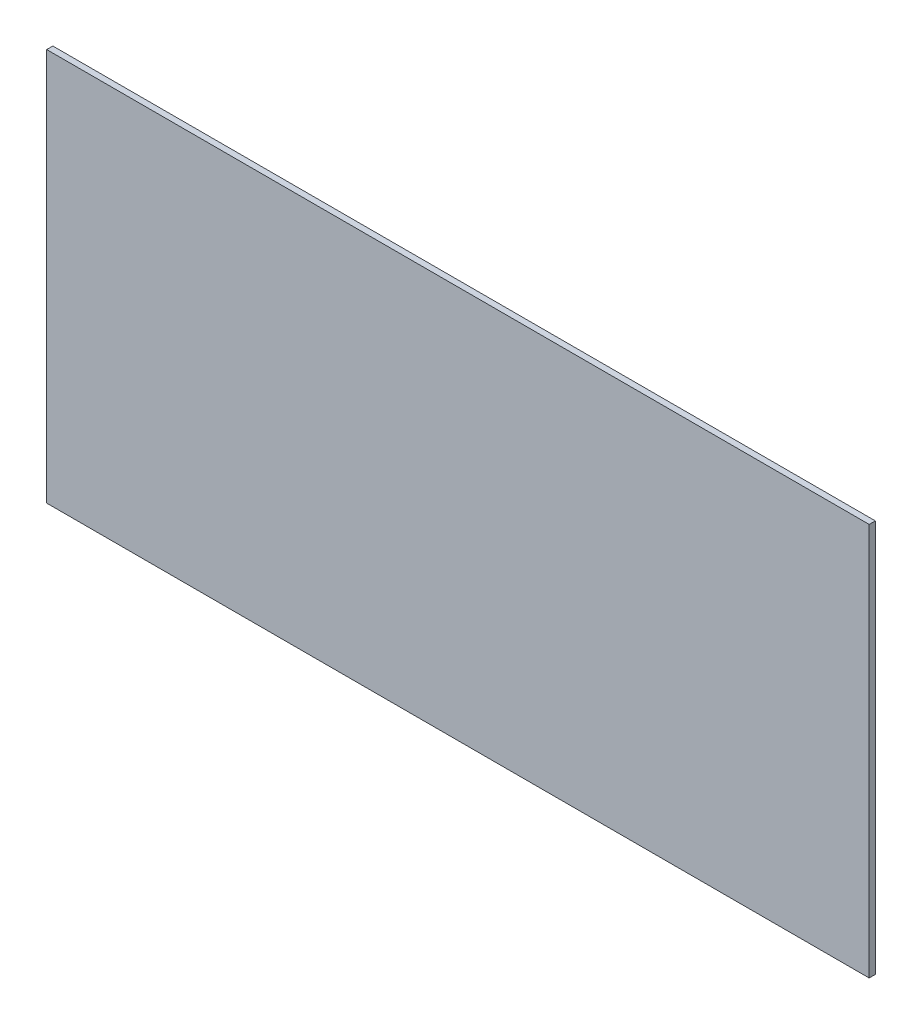
ISO-10303-21;
HEADER;
FILE_DESCRIPTION(('STEP AP214'),'2;1');
FILE_NAME('part.step','',(''),(''),'','','');
FILE_SCHEMA(('AUTOMOTIVE_DESIGN { 1 0 10303 214 1 1 1 1 }'));
ENDSEC;
DATA;
#1=APPLICATION_CONTEXT('core data for automotive mechanical design processes');
#2=APPLICATION_PROTOCOL_DEFINITION('international standard','automotive_design',2000,#1);
#3=PRODUCT_CONTEXT('',#1,'mechanical');
#4=PRODUCT('Part','Part','',(#3));
#5=PRODUCT_RELATED_PRODUCT_CATEGORY('part','',(#4));
#6=PRODUCT_DEFINITION_FORMATION('','',#4);
#7=PRODUCT_DEFINITION_CONTEXT('part definition',#1,'design');
#8=PRODUCT_DEFINITION('design','',#6,#7);
#9=PRODUCT_DEFINITION_SHAPE('','',#8);
#10=(LENGTH_UNIT() NAMED_UNIT(*) SI_UNIT(.MILLI.,.METRE.));
#11=(NAMED_UNIT(*) PLANE_ANGLE_UNIT() SI_UNIT($,.RADIAN.));
#12=(NAMED_UNIT(*) SI_UNIT($,.STERADIAN.) SOLID_ANGLE_UNIT());
#13=UNCERTAINTY_MEASURE_WITH_UNIT(LENGTH_MEASURE(1.E-05),#10,'distance_accuracy_value','');
#14=(GEOMETRIC_REPRESENTATION_CONTEXT(3) GLOBAL_UNCERTAINTY_ASSIGNED_CONTEXT((#13)) GLOBAL_UNIT_ASSIGNED_CONTEXT((#10,
#11,#12)) REPRESENTATION_CONTEXT('',''));
#15=CARTESIAN_POINT('',(0.,0.,0.));
#16=DIRECTION('',(0.,0.,1.));
#17=DIRECTION('',(1.,0.,0.));
#18=AXIS2_PLACEMENT_3D('',#15,#16,#17);
#19=CARTESIAN_POINT('',(-604.30004543329,321.842900302115,10.));
#20=DIRECTION('',(1.,0.,0.));
#21=DIRECTION('',(0.,1.,0.));
#22=AXIS2_PLACEMENT_3D('',#19,#20,#21);
#23=PLANE('',#22);
#24=DIRECTION('',(0.,-1.,0.));
#25=VECTOR('',#24,1.);
#26=CARTESIAN_POINT('',(-604.30004543329,321.842900302115,0.));
#27=LINE('',#26,#25);
#28=CARTESIAN_POINT('',(-604.30004543329,321.842900302115,0.));
#29=VERTEX_POINT('',#28);
#30=CARTESIAN_POINT('',(-604.30004543329,-318.157099697885,0.));
#31=VERTEX_POINT('',#30);
#32=EDGE_CURVE('E97',#29,#31,#27,.T.);
#33=ORIENTED_EDGE('',*,*,#32,.T.);
#34=DIRECTION('',(0.,0.,-1.));
#35=VECTOR('',#34,1.);
#36=CARTESIAN_POINT('',(-604.30004543329,-318.157099697885,10.));
#37=LINE('',#36,#35);
#38=CARTESIAN_POINT('',(-604.30004543329,-318.157099697885,10.));
#39=VERTEX_POINT('',#38);
#40=EDGE_CURVE('E11',#39,#31,#37,.T.);
#41=ORIENTED_EDGE('',*,*,#40,.F.);
#42=DIRECTION('',(0.,-1.,0.));
#43=VECTOR('',#42,1.);
#44=CARTESIAN_POINT('',(-604.30004543329,321.842900302115,10.));
#45=LINE('',#44,#43);
#46=CARTESIAN_POINT('',(-604.30004543329,321.842900302115,10.));
#47=VERTEX_POINT('',#46);
#48=EDGE_CURVE('E85',#47,#39,#45,.T.);
#49=ORIENTED_EDGE('',*,*,#48,.F.);
#50=DIRECTION('',(0.,0.,-1.));
#51=VECTOR('',#50,1.);
#52=CARTESIAN_POINT('',(-604.30004543329,321.842900302115,10.));
#53=LINE('',#52,#51);
#54=EDGE_CURVE('E93',#47,#29,#53,.T.);
#55=ORIENTED_EDGE('',*,*,#54,.T.);
#56=EDGE_LOOP('',(#33,#41,#49,#55));
#57=FACE_BOUND('',#56,.T.);
#58=ADVANCED_FACE('F34',(#57),#23,.F.);
#59=CARTESIAN_POINT('',(-604.30004543329,-318.157099697885,10.));
#60=DIRECTION('',(0.,1.,0.));
#61=DIRECTION('',(0.,0.,1.));
#62=AXIS2_PLACEMENT_3D('',#59,#60,#61);
#63=PLANE('',#62);
#64=DIRECTION('',(1.,0.,0.));
#65=VECTOR('',#64,1.);
#66=CARTESIAN_POINT('',(-604.30004543329,-318.157099697885,0.));
#67=LINE('',#66,#65);
#68=CARTESIAN_POINT('',(735.69995456671,-318.157099697885,0.));
#69=VERTEX_POINT('',#68);
#70=EDGE_CURVE('E89',#31,#69,#67,.T.);
#71=ORIENTED_EDGE('',*,*,#70,.T.);
#72=DIRECTION('',(0.,0.,-1.));
#73=VECTOR('',#72,1.);
#74=CARTESIAN_POINT('',(735.69995456671,-318.157099697885,10.));
#75=LINE('',#74,#73);
#76=CARTESIAN_POINT('',(735.69995456671,-318.157099697885,10.));
#77=VERTEX_POINT('',#76);
#78=EDGE_CURVE('E42',#77,#69,#75,.T.);
#79=ORIENTED_EDGE('',*,*,#78,.F.);
#80=DIRECTION('',(1.,0.,0.));
#81=VECTOR('',#80,1.);
#82=CARTESIAN_POINT('',(-604.30004543329,-318.157099697885,10.));
#83=LINE('',#82,#81);
#84=EDGE_CURVE('E80',#39,#77,#83,.T.);
#85=ORIENTED_EDGE('',*,*,#84,.F.);
#86=ORIENTED_EDGE('',*,*,#40,.T.);
#87=EDGE_LOOP('',(#71,#79,#85,#86));
#88=FACE_BOUND('',#87,.T.);
#89=ADVANCED_FACE('F88',(#88),#63,.F.);
#90=CARTESIAN_POINT('',(735.69995456671,321.842900302115,10.));
#91=DIRECTION('',(-1.,0.,0.));
#92=DIRECTION('',(0.,-1.,0.));
#93=AXIS2_PLACEMENT_3D('',#90,#91,#92);
#94=PLANE('',#93);
#95=DIRECTION('',(0.,1.,0.));
#96=VECTOR('',#95,1.);
#97=CARTESIAN_POINT('',(735.69995456671,321.842900302115,0.));
#98=LINE('',#97,#96);
#99=CARTESIAN_POINT('',(735.69995456671,321.842900302115,0.));
#100=VERTEX_POINT('',#99);
#101=EDGE_CURVE('E67',#69,#100,#98,.T.);
#102=ORIENTED_EDGE('',*,*,#101,.T.);
#103=DIRECTION('',(0.,0.,-1.));
#104=VECTOR('',#103,1.);
#105=CARTESIAN_POINT('',(735.69995456671,321.842900302115,10.));
#106=LINE('',#105,#104);
#107=CARTESIAN_POINT('',(735.69995456671,321.842900302115,10.));
#108=VERTEX_POINT('',#107);
#109=EDGE_CURVE('E90',#108,#100,#106,.T.);
#110=ORIENTED_EDGE('',*,*,#109,.F.);
#111=DIRECTION('',(0.,1.,0.));
#112=VECTOR('',#111,1.);
#113=CARTESIAN_POINT('',(735.69995456671,321.842900302115,10.));
#114=LINE('',#113,#112);
#115=EDGE_CURVE('E83',#77,#108,#114,.T.);
#116=ORIENTED_EDGE('',*,*,#115,.F.);
#117=ORIENTED_EDGE('',*,*,#78,.T.);
#118=EDGE_LOOP('',(#102,#110,#116,#117));
#119=FACE_BOUND('',#118,.T.);
#120=ADVANCED_FACE('F91',(#119),#94,.F.);
#121=CARTESIAN_POINT('',(-604.30004543329,321.842900302115,10.));
#122=DIRECTION('',(0.,-1.,0.));
#123=DIRECTION('',(0.,0.,-1.));
#124=AXIS2_PLACEMENT_3D('',#121,#122,#123);
#125=PLANE('',#124);
#126=DIRECTION('',(-1.,0.,0.));
#127=VECTOR('',#126,1.);
#128=CARTESIAN_POINT('',(-604.30004543329,321.842900302115,0.));
#129=LINE('',#128,#127);
#130=EDGE_CURVE('E73',#100,#29,#129,.T.);
#131=ORIENTED_EDGE('',*,*,#130,.T.);
#132=ORIENTED_EDGE('',*,*,#54,.F.);
#133=DIRECTION('',(-1.,0.,0.));
#134=VECTOR('',#133,1.);
#135=CARTESIAN_POINT('',(-604.30004543329,321.842900302115,10.));
#136=LINE('',#135,#134);
#137=EDGE_CURVE('E50',#108,#47,#136,.T.);
#138=ORIENTED_EDGE('',*,*,#137,.F.);
#139=ORIENTED_EDGE('',*,*,#109,.T.);
#140=EDGE_LOOP('',(#131,#132,#138,#139));
#141=FACE_BOUND('',#140,.T.);
#142=ADVANCED_FACE('F104',(#141),#125,.F.);
#143=CARTESIAN_POINT('',(0.,0.,10.));
#144=DIRECTION('',(0.,0.,1.));
#145=DIRECTION('',(1.,0.,0.));
#146=AXIS2_PLACEMENT_3D('',#143,#144,#145);
#147=PLANE('',#146);
#148=ORIENTED_EDGE('',*,*,#48,.T.);
#149=ORIENTED_EDGE('',*,*,#84,.T.);
#150=ORIENTED_EDGE('',*,*,#115,.T.);
#151=ORIENTED_EDGE('',*,*,#137,.T.);
#152=EDGE_LOOP('',(#148,#149,#150,#151));
#153=FACE_BOUND('',#152,.T.);
#154=ADVANCED_FACE('F81',(#153),#147,.T.);
#155=CARTESIAN_POINT('',(0.,0.,0.));
#156=DIRECTION('',(0.,0.,1.));
#157=DIRECTION('',(1.,0.,0.));
#158=AXIS2_PLACEMENT_3D('',#155,#156,#157);
#159=PLANE('',#158);
#160=ORIENTED_EDGE('',*,*,#32,.F.);
#161=ORIENTED_EDGE('',*,*,#130,.F.);
#162=ORIENTED_EDGE('',*,*,#101,.F.);
#163=ORIENTED_EDGE('',*,*,#70,.F.);
#164=EDGE_LOOP('',(#160,#161,#162,#163));
#165=FACE_BOUND('',#164,.T.);
#166=ADVANCED_FACE('F107',(#165),#159,.F.);
#167=CLOSED_SHELL('',(#58,#89,#120,#142,#154,#166));
#168=MANIFOLD_SOLID_BREP('B2',#167);
#169=ADVANCED_BREP_SHAPE_REPRESENTATION('',(#18,#168),#14);
#170=SHAPE_DEFINITION_REPRESENTATION(#9,#169);
ENDSEC;
END-ISO-10303-21;
